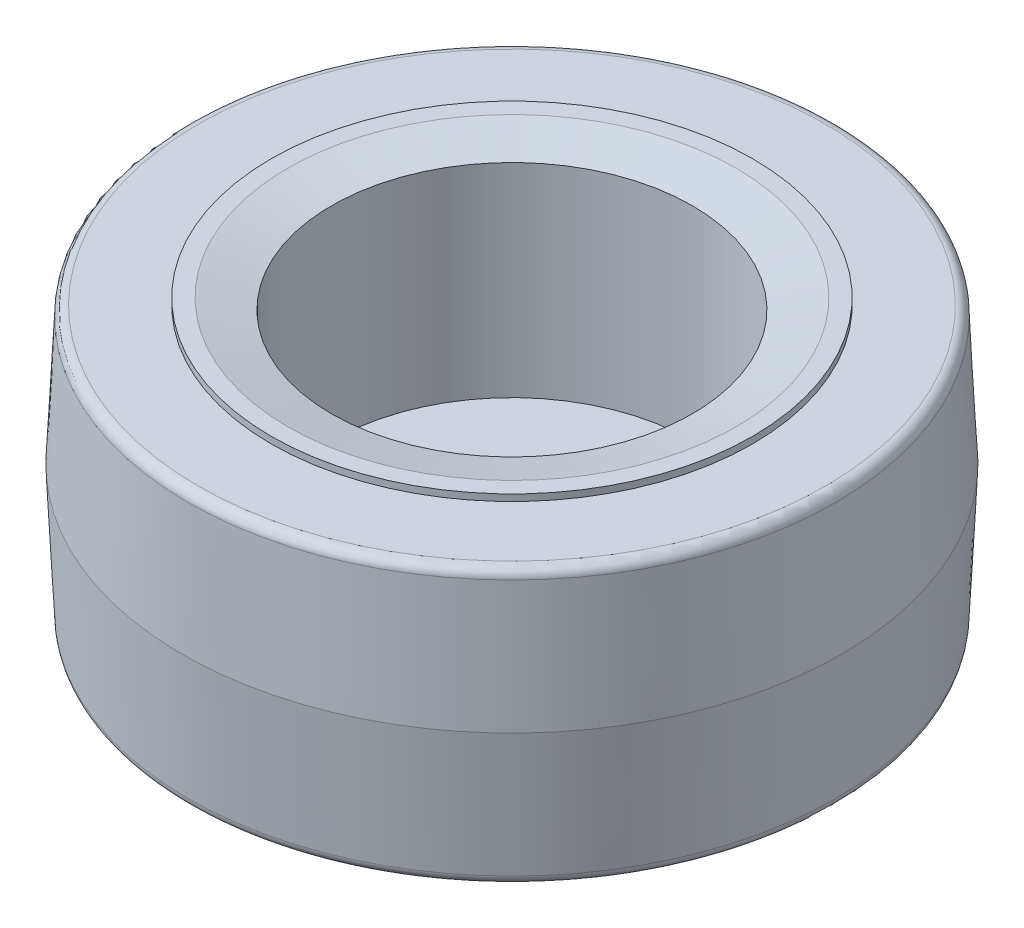
ISO-10303-21;
HEADER;
FILE_DESCRIPTION(('STEP AP214'),'2;1');
FILE_NAME('part.step','',(''),(''),'','','');
FILE_SCHEMA(('AUTOMOTIVE_DESIGN { 1 0 10303 214 1 1 1 1 }'));
ENDSEC;
DATA;
#1=APPLICATION_CONTEXT('core data for automotive mechanical design processes');
#2=APPLICATION_PROTOCOL_DEFINITION('international standard','automotive_design',2000,#1);
#3=PRODUCT_CONTEXT('',#1,'mechanical');
#4=PRODUCT('Part','Part','',(#3));
#5=PRODUCT_RELATED_PRODUCT_CATEGORY('part','',(#4));
#6=PRODUCT_DEFINITION_FORMATION('','',#4);
#7=PRODUCT_DEFINITION_CONTEXT('part definition',#1,'design');
#8=PRODUCT_DEFINITION('design','',#6,#7);
#9=PRODUCT_DEFINITION_SHAPE('','',#8);
#10=(LENGTH_UNIT() NAMED_UNIT(*) SI_UNIT(.MILLI.,.METRE.));
#11=(NAMED_UNIT(*) PLANE_ANGLE_UNIT() SI_UNIT($,.RADIAN.));
#12=(NAMED_UNIT(*) SI_UNIT($,.STERADIAN.) SOLID_ANGLE_UNIT());
#13=UNCERTAINTY_MEASURE_WITH_UNIT(LENGTH_MEASURE(1.E-05),#10,'distance_accuracy_value','');
#14=(GEOMETRIC_REPRESENTATION_CONTEXT(3) GLOBAL_UNCERTAINTY_ASSIGNED_CONTEXT((#13)) GLOBAL_UNIT_ASSIGNED_CONTEXT((#10,
#11,#12)) REPRESENTATION_CONTEXT('',''));
#15=CARTESIAN_POINT('',(0.,0.,0.));
#16=DIRECTION('',(0.,0.,1.));
#17=DIRECTION('',(1.,0.,0.));
#18=AXIS2_PLACEMENT_3D('',#15,#16,#17);
#19=CARTESIAN_POINT('',(0.,0.,0.));
#20=DIRECTION('',(0.,-1.,0.));
#21=DIRECTION('',(0.,0.,-1.));
#22=AXIS2_PLACEMENT_3D('',#19,#20,#21);
#23=CYLINDRICAL_SURFACE('',#22,6.35);
#24=CARTESIAN_POINT('',(0.,-11.1125,0.));
#25=DIRECTION('',(0.,-1.,0.));
#26=DIRECTION('',(0.,0.,-1.));
#27=AXIS2_PLACEMENT_3D('',#24,#25,#26);
#28=CIRCLE('',#27,6.35);
#29=CARTESIAN_POINT('',(0.,-11.1125,-6.35));
#30=VERTEX_POINT('',#29);
#31=EDGE_CURVE('E54',#30,#30,#28,.T.);
#32=ORIENTED_EDGE('',*,*,#31,.T.);
#33=EDGE_LOOP('',(#32));
#34=FACE_BOUND('',#33,.T.);
#35=CARTESIAN_POINT('',(0.,-5.3975,0.));
#36=DIRECTION('',(0.,1.,0.));
#37=DIRECTION('',(0.,0.,1.));
#38=AXIS2_PLACEMENT_3D('',#35,#36,#37);
#39=CIRCLE('',#38,6.35);
#40=CARTESIAN_POINT('',(0.,-5.3975,6.35));
#41=VERTEX_POINT('',#40);
#42=EDGE_CURVE('E48',#41,#41,#39,.T.);
#43=ORIENTED_EDGE('',*,*,#42,.T.);
#44=EDGE_LOOP('',(#43));
#45=FACE_BOUND('',#44,.T.);
#46=ADVANCED_FACE('F32',(#34,#45),#23,.F.);
#47=CARTESIAN_POINT('',(0.,11.1125,0.));
#48=DIRECTION('',(0.,1.,0.));
#49=DIRECTION('',(0.,0.,1.));
#50=AXIS2_PLACEMENT_3D('',#47,#48,#49);
#51=CONICAL_SURFACE('',#50,17.272,1.33296039933745);
#52=CARTESIAN_POINT('',(0.,10.2950818181818,0.));
#53=DIRECTION('',(0.,1.,0.));
#54=DIRECTION('',(0.,0.,1.));
#55=AXIS2_PLACEMENT_3D('',#52,#53,#54);
#56=CIRCLE('',#55,13.90015);
#57=CARTESIAN_POINT('',(0.,10.2950818181818,13.90015));
#58=VERTEX_POINT('',#57);
#59=EDGE_CURVE('E36',#58,#58,#56,.T.);
#60=ORIENTED_EDGE('',*,*,#59,.F.);
#61=EDGE_LOOP('',(#60));
#62=FACE_BOUND('',#61,.T.);
#63=CARTESIAN_POINT('',(0.,11.1125,0.));
#64=DIRECTION('',(0.,-1.,0.));
#65=DIRECTION('',(0.,0.,-1.));
#66=AXIS2_PLACEMENT_3D('',#63,#64,#65);
#67=CIRCLE('',#66,17.272);
#68=CARTESIAN_POINT('',(0.,11.1125,-17.272));
#69=VERTEX_POINT('',#68);
#70=EDGE_CURVE('E89',#69,#69,#67,.T.);
#71=ORIENTED_EDGE('',*,*,#70,.F.);
#72=EDGE_LOOP('',(#71));
#73=FACE_BOUND('',#72,.T.);
#74=ADVANCED_FACE('F148',(#62,#73),#51,.F.);
#75=CARTESIAN_POINT('',(17.272,11.1125,0.));
#76=DIRECTION('',(0.,1.,0.));
#77=DIRECTION('',(0.,0.,1.));
#78=AXIS2_PLACEMENT_3D('',#75,#76,#77);
#79=PLANE('',#78);
#80=ORIENTED_EDGE('',*,*,#70,.T.);
#81=EDGE_LOOP('',(#80));
#82=FACE_BOUND('',#81,.T.);
#83=CARTESIAN_POINT('',(0.,11.1125,0.));
#84=DIRECTION('',(0.,-1.,0.));
#85=DIRECTION('',(0.,0.,-1.));
#86=AXIS2_PLACEMENT_3D('',#83,#84,#85);
#87=CIRCLE('',#86,18.542);
#88=CARTESIAN_POINT('',(0.,11.1125,-18.542));
#89=VERTEX_POINT('',#88);
#90=EDGE_CURVE('E86',#89,#89,#87,.T.);
#91=ORIENTED_EDGE('',*,*,#90,.F.);
#92=EDGE_LOOP('',(#91));
#93=FACE_BOUND('',#92,.T.);
#94=ADVANCED_FACE('F153',(#82,#93),#79,.T.);
#95=CARTESIAN_POINT('',(0.,0.,0.));
#96=DIRECTION('',(0.,-1.,0.));
#97=DIRECTION('',(0.,0.,-1.));
#98=AXIS2_PLACEMENT_3D('',#95,#96,#97);
#99=CYLINDRICAL_SURFACE('',#98,18.542);
#100=ORIENTED_EDGE('',*,*,#90,.T.);
#101=EDGE_LOOP('',(#100));
#102=FACE_BOUND('',#101,.T.);
#103=CARTESIAN_POINT('',(0.,10.6045,0.));
#104=DIRECTION('',(0.,-1.,0.));
#105=DIRECTION('',(0.,0.,-1.));
#106=AXIS2_PLACEMENT_3D('',#103,#104,#105);
#107=CIRCLE('',#106,18.542);
#108=CARTESIAN_POINT('',(0.,10.6045,-18.542));
#109=VERTEX_POINT('',#108);
#110=EDGE_CURVE('E83',#109,#109,#107,.T.);
#111=ORIENTED_EDGE('',*,*,#110,.F.);
#112=EDGE_LOOP('',(#111));
#113=FACE_BOUND('',#112,.T.);
#114=ADVANCED_FACE('F169',(#102,#113),#99,.T.);
#115=CARTESIAN_POINT('',(18.542,10.6045,0.));
#116=DIRECTION('',(0.,1.,0.));
#117=DIRECTION('',(0.,0.,1.));
#118=AXIS2_PLACEMENT_3D('',#115,#116,#117);
#119=PLANE('',#118);
#120=CARTESIAN_POINT('',(0.,10.6045,0.));
#121=DIRECTION('',(0.,1.,0.));
#122=DIRECTION('',(0.,0.,1.));
#123=AXIS2_PLACEMENT_3D('',#120,#121,#122);
#124=CIRCLE('',#123,24.1656291718291);
#125=CARTESIAN_POINT('',(0.,10.6045,24.1656291718291));
#126=VERTEX_POINT('',#125);
#127=EDGE_CURVE('E10',#126,#126,#124,.T.);
#128=ORIENTED_EDGE('',*,*,#127,.T.);
#129=EDGE_LOOP('',(#128));
#130=FACE_BOUND('',#129,.T.);
#131=ORIENTED_EDGE('',*,*,#110,.T.);
#132=EDGE_LOOP('',(#131));
#133=FACE_BOUND('',#132,.T.);
#134=ADVANCED_FACE('F165',(#130,#133),#119,.T.);
#135=CARTESIAN_POINT('',(0.,0.,0.));
#136=DIRECTION('',(0.,-1.,0.));
#137=DIRECTION('',(0.,0.,-1.));
#138=AXIS2_PLACEMENT_3D('',#135,#136,#137);
#139=CONICAL_SURFACE('',#138,25.4,0.0478675982906456);
#140=CARTESIAN_POINT('',(0.,9.87896118221421,0.));
#141=DIRECTION('',(0.,1.,0.));
#142=DIRECTION('',(0.,0.,1.));
#143=AXIS2_PLACEMENT_3D('',#140,#141,#142);
#144=CIRCLE('',#143,24.9267563505526);
#145=CARTESIAN_POINT('',(0.,9.87896118221421,24.9267563505526));
#146=VERTEX_POINT('',#145);
#147=EDGE_CURVE('E40',#146,#146,#144,.F.);
#148=ORIENTED_EDGE('',*,*,#147,.T.);
#149=EDGE_LOOP('',(#148));
#150=FACE_BOUND('',#149,.T.);
#151=CARTESIAN_POINT('',(0.,0.,0.));
#152=DIRECTION('',(0.,-1.,0.));
#153=DIRECTION('',(0.,0.,-1.));
#154=AXIS2_PLACEMENT_3D('',#151,#152,#153);
#155=CIRCLE('',#154,25.4);
#156=CARTESIAN_POINT('',(0.,0.,-25.4));
#157=VERTEX_POINT('',#156);
#158=EDGE_CURVE('E80',#157,#157,#155,.T.);
#159=ORIENTED_EDGE('',*,*,#158,.F.);
#160=EDGE_LOOP('',(#159));
#161=FACE_BOUND('',#160,.T.);
#162=ADVANCED_FACE('F162',(#150,#161),#139,.T.);
#163=CARTESIAN_POINT('',(0.,-10.6045,0.));
#164=DIRECTION('',(0.,1.,0.));
#165=DIRECTION('',(0.,0.,1.));
#166=AXIS2_PLACEMENT_3D('',#163,#164,#165);
#167=CONICAL_SURFACE('',#166,24.892,0.0478675982906456);
#168=CARTESIAN_POINT('',(0.,-9.87896118221421,0.));
#169=DIRECTION('',(0.,-1.,0.));
#170=DIRECTION('',(0.,0.,-1.));
#171=AXIS2_PLACEMENT_3D('',#168,#169,#170);
#172=CIRCLE('',#171,24.9267563505526);
#173=CARTESIAN_POINT('',(0.,-9.87896118221421,-24.9267563505526));
#174=VERTEX_POINT('',#173);
#175=EDGE_CURVE('E45',#174,#174,#172,.F.);
#176=ORIENTED_EDGE('',*,*,#175,.T.);
#177=EDGE_LOOP('',(#176));
#178=FACE_BOUND('',#177,.T.);
#179=ORIENTED_EDGE('',*,*,#158,.T.);
#180=EDGE_LOOP('',(#179));
#181=FACE_BOUND('',#180,.T.);
#182=ADVANCED_FACE('F97',(#178,#181),#167,.T.);
#183=CARTESIAN_POINT('',(18.542,-10.6045,0.));
#184=DIRECTION('',(0.,-1.,0.));
#185=DIRECTION('',(0.,0.,-1.));
#186=AXIS2_PLACEMENT_3D('',#183,#184,#185);
#187=PLANE('',#186);
#188=CARTESIAN_POINT('',(0.,-10.6045,0.));
#189=DIRECTION('',(0.,-1.,0.));
#190=DIRECTION('',(0.,0.,-1.));
#191=AXIS2_PLACEMENT_3D('',#188,#189,#190);
#192=CIRCLE('',#191,24.1656291718291);
#193=CARTESIAN_POINT('',(0.,-10.6045,-24.1656291718291));
#194=VERTEX_POINT('',#193);
#195=EDGE_CURVE('E92',#194,#194,#192,.T.);
#196=ORIENTED_EDGE('',*,*,#195,.T.);
#197=EDGE_LOOP('',(#196));
#198=FACE_BOUND('',#197,.T.);
#199=CARTESIAN_POINT('',(0.,-10.6045,0.));
#200=DIRECTION('',(0.,-1.,0.));
#201=DIRECTION('',(0.,0.,-1.));
#202=AXIS2_PLACEMENT_3D('',#199,#200,#201);
#203=CIRCLE('',#202,18.542);
#204=CARTESIAN_POINT('',(0.,-10.6045,-18.542));
#205=VERTEX_POINT('',#204);
#206=EDGE_CURVE('E77',#205,#205,#203,.T.);
#207=ORIENTED_EDGE('',*,*,#206,.F.);
#208=EDGE_LOOP('',(#207));
#209=FACE_BOUND('',#208,.T.);
#210=ADVANCED_FACE('F106',(#198,#209),#187,.T.);
#211=CARTESIAN_POINT('',(0.,0.,0.));
#212=DIRECTION('',(0.,-1.,0.));
#213=DIRECTION('',(0.,0.,-1.));
#214=AXIS2_PLACEMENT_3D('',#211,#212,#213);
#215=CYLINDRICAL_SURFACE('',#214,18.542);
#216=ORIENTED_EDGE('',*,*,#206,.T.);
#217=EDGE_LOOP('',(#216));
#218=FACE_BOUND('',#217,.T.);
#219=CARTESIAN_POINT('',(0.,-11.1125,0.));
#220=DIRECTION('',(0.,-1.,0.));
#221=DIRECTION('',(0.,0.,-1.));
#222=AXIS2_PLACEMENT_3D('',#219,#220,#221);
#223=CIRCLE('',#222,18.542);
#224=CARTESIAN_POINT('',(0.,-11.1125,-18.542));
#225=VERTEX_POINT('',#224);
#226=EDGE_CURVE('E74',#225,#225,#223,.T.);
#227=ORIENTED_EDGE('',*,*,#226,.F.);
#228=EDGE_LOOP('',(#227));
#229=FACE_BOUND('',#228,.T.);
#230=ADVANCED_FACE('F109',(#218,#229),#215,.T.);
#231=CARTESIAN_POINT('',(17.272,-11.1125,0.));
#232=DIRECTION('',(0.,-1.,0.));
#233=DIRECTION('',(0.,0.,-1.));
#234=AXIS2_PLACEMENT_3D('',#231,#232,#233);
#235=PLANE('',#234);
#236=ORIENTED_EDGE('',*,*,#226,.T.);
#237=EDGE_LOOP('',(#236));
#238=FACE_BOUND('',#237,.T.);
#239=CARTESIAN_POINT('',(0.,-11.1125,0.));
#240=DIRECTION('',(0.,-1.,0.));
#241=DIRECTION('',(0.,0.,-1.));
#242=AXIS2_PLACEMENT_3D('',#239,#240,#241);
#243=CIRCLE('',#242,17.272);
#244=CARTESIAN_POINT('',(0.,-11.1125,-17.272));
#245=VERTEX_POINT('',#244);
#246=EDGE_CURVE('E71',#245,#245,#243,.T.);
#247=ORIENTED_EDGE('',*,*,#246,.F.);
#248=EDGE_LOOP('',(#247));
#249=FACE_BOUND('',#248,.T.);
#250=ADVANCED_FACE('F115',(#238,#249),#235,.T.);
#251=CARTESIAN_POINT('',(0.,-9.90970070815046,0.));
#252=DIRECTION('',(0.,-1.,0.));
#253=DIRECTION('',(0.,0.,-1.));
#254=AXIS2_PLACEMENT_3D('',#251,#252,#253);
#255=CONICAL_SURFACE('',#254,12.3104529211206,1.33296039933745);
#256=ORIENTED_EDGE('',*,*,#246,.T.);
#257=EDGE_LOOP('',(#256));
#258=FACE_BOUND('',#257,.T.);
#259=CARTESIAN_POINT('',(0.,-9.90970070815046,0.));
#260=DIRECTION('',(0.,-1.,0.));
#261=DIRECTION('',(0.,0.,-1.));
#262=AXIS2_PLACEMENT_3D('',#259,#260,#261);
#263=CIRCLE('',#262,12.3104529211206);
#264=CARTESIAN_POINT('',(0.,-9.90970070815046,-12.3104529211206));
#265=VERTEX_POINT('',#264);
#266=EDGE_CURVE('E68',#265,#265,#263,.T.);
#267=ORIENTED_EDGE('',*,*,#266,.F.);
#268=EDGE_LOOP('',(#267));
#269=FACE_BOUND('',#268,.T.);
#270=ADVANCED_FACE('F121',(#258,#269),#255,.F.);
#271=CARTESIAN_POINT('',(0.,-11.8845001229099,0.));
#272=DIRECTION('',(0.,-1.,0.));
#273=DIRECTION('',(0.,0.,-1.));
#274=AXIS2_PLACEMENT_3D('',#271,#272,#273);
#275=TOROIDAL_SURFACE('',#274,11.8317136690578,2.032);
#276=ORIENTED_EDGE('',*,*,#266,.T.);
#277=EDGE_LOOP('',(#276));
#278=FACE_BOUND('',#277,.T.);
#279=CARTESIAN_POINT('',(0.,-10.482500061455,0.));
#280=DIRECTION('',(0.,-1.,0.));
#281=DIRECTION('',(0.,0.,-1.));
#282=AXIS2_PLACEMENT_3D('',#279,#280,#281);
#283=CIRCLE('',#282,10.3608568345289);
#284=CARTESIAN_POINT('',(0.,-10.482500061455,-10.3608568345289));
#285=VERTEX_POINT('',#284);
#286=EDGE_CURVE('E65',#285,#285,#283,.T.);
#287=ORIENTED_EDGE('',*,*,#286,.F.);
#288=EDGE_LOOP('',(#287));
#289=FACE_BOUND('',#288,.T.);
#290=ADVANCED_FACE('F127',(#278,#289),#275,.F.);
#291=CARTESIAN_POINT('',(0.,-9.08049999999999,0.));
#292=DIRECTION('',(0.,-1.,0.));
#293=DIRECTION('',(0.,0.,-1.));
#294=AXIS2_PLACEMENT_3D('',#291,#292,#293);
#295=TOROIDAL_SURFACE('',#294,8.89,2.03200000000001);
#296=ORIENTED_EDGE('',*,*,#286,.T.);
#297=EDGE_LOOP('',(#296));
#298=FACE_BOUND('',#297,.T.);
#299=CARTESIAN_POINT('',(0.,-11.1125,0.));
#300=DIRECTION('',(0.,-1.,0.));
#301=DIRECTION('',(0.,0.,-1.));
#302=AXIS2_PLACEMENT_3D('',#299,#300,#301);
#303=CIRCLE('',#302,8.89);
#304=CARTESIAN_POINT('',(0.,-11.1125,-8.89));
#305=VERTEX_POINT('',#304);
#306=EDGE_CURVE('E62',#305,#305,#303,.T.);
#307=ORIENTED_EDGE('',*,*,#306,.F.);
#308=EDGE_LOOP('',(#307));
#309=FACE_BOUND('',#308,.T.);
#310=ADVANCED_FACE('F133',(#298,#309),#295,.T.);
#311=CARTESIAN_POINT('',(6.35,-11.1125,0.));
#312=DIRECTION('',(0.,-1.,0.));
#313=DIRECTION('',(0.,0.,-1.));
#314=AXIS2_PLACEMENT_3D('',#311,#312,#313);
#315=PLANE('',#314);
#316=ORIENTED_EDGE('',*,*,#306,.T.);
#317=EDGE_LOOP('',(#316));
#318=FACE_BOUND('',#317,.T.);
#319=ORIENTED_EDGE('',*,*,#31,.F.);
#320=EDGE_LOOP('',(#319));
#321=FACE_BOUND('',#320,.T.);
#322=ADVANCED_FACE('F103',(#318,#321),#315,.T.);
#323=CARTESIAN_POINT('',(0.,-9.8425,0.));
#324=DIRECTION('',(0.,-1.,0.));
#325=DIRECTION('',(0.,0.,-1.));
#326=AXIS2_PLACEMENT_3D('',#323,#324,#325);
#327=TOROIDAL_SURFACE('',#326,24.1656291718291,0.762);
#328=ORIENTED_EDGE('',*,*,#175,.F.);
#329=EDGE_LOOP('',(#328));
#330=FACE_BOUND('',#329,.T.);
#331=ORIENTED_EDGE('',*,*,#195,.F.);
#332=EDGE_LOOP('',(#331));
#333=FACE_BOUND('',#332,.T.);
#334=ADVANCED_FACE('F100',(#330,#333),#327,.T.);
#335=CARTESIAN_POINT('',(0.,9.8425,0.));
#336=DIRECTION('',(0.,1.,0.));
#337=DIRECTION('',(0.,0.,1.));
#338=AXIS2_PLACEMENT_3D('',#335,#336,#337);
#339=TOROIDAL_SURFACE('',#338,24.1656291718291,0.762);
#340=ORIENTED_EDGE('',*,*,#127,.F.);
#341=EDGE_LOOP('',(#340));
#342=FACE_BOUND('',#341,.T.);
#343=ORIENTED_EDGE('',*,*,#147,.F.);
#344=EDGE_LOOP('',(#343));
#345=FACE_BOUND('',#344,.T.);
#346=ADVANCED_FACE('F34',(#342,#345),#339,.T.);
#347=CARTESIAN_POINT('',(0.,-5.3975,0.));
#348=DIRECTION('',(0.,1.,0.));
#349=DIRECTION('',(0.,0.,1.));
#350=AXIS2_PLACEMENT_3D('',#347,#348,#349);
#351=CYLINDRICAL_SURFACE('',#350,13.90015);
#352=ORIENTED_EDGE('',*,*,#59,.T.);
#353=EDGE_LOOP('',(#352));
#354=FACE_BOUND('',#353,.T.);
#355=CARTESIAN_POINT('',(0.,-5.3975,0.));
#356=DIRECTION('',(0.,1.,0.));
#357=DIRECTION('',(0.,0.,1.));
#358=AXIS2_PLACEMENT_3D('',#355,#356,#357);
#359=CIRCLE('',#358,13.90015);
#360=CARTESIAN_POINT('',(0.,-5.3975,13.90015));
#361=VERTEX_POINT('',#360);
#362=EDGE_CURVE('E50',#361,#361,#359,.T.);
#363=ORIENTED_EDGE('',*,*,#362,.F.);
#364=EDGE_LOOP('',(#363));
#365=FACE_BOUND('',#364,.T.);
#366=ADVANCED_FACE('F157',(#354,#365),#351,.F.);
#367=CARTESIAN_POINT('',(0.,-5.3975,0.));
#368=DIRECTION('',(0.,1.,0.));
#369=DIRECTION('',(0.,0.,1.));
#370=AXIS2_PLACEMENT_3D('',#367,#368,#369);
#371=PLANE('',#370);
#372=ORIENTED_EDGE('',*,*,#42,.F.);
#373=EDGE_LOOP('',(#372));
#374=FACE_BOUND('',#373,.T.);
#375=ORIENTED_EDGE('',*,*,#362,.T.);
#376=EDGE_LOOP('',(#375));
#377=FACE_BOUND('',#376,.T.);
#378=ADVANCED_FACE('F246',(#374,#377),#371,.T.);
#379=CLOSED_SHELL('',(#46,#74,#94,#114,#134,#162,#182,#210,#230,#250,#270,#290,#310,#322,#334,
#346,#366,#378));
#380=MANIFOLD_SOLID_BREP('B2',#379);
#381=ADVANCED_BREP_SHAPE_REPRESENTATION('',(#18,#380),#14);
#382=SHAPE_DEFINITION_REPRESENTATION(#9,#381);
ENDSEC;
END-ISO-10303-21;
